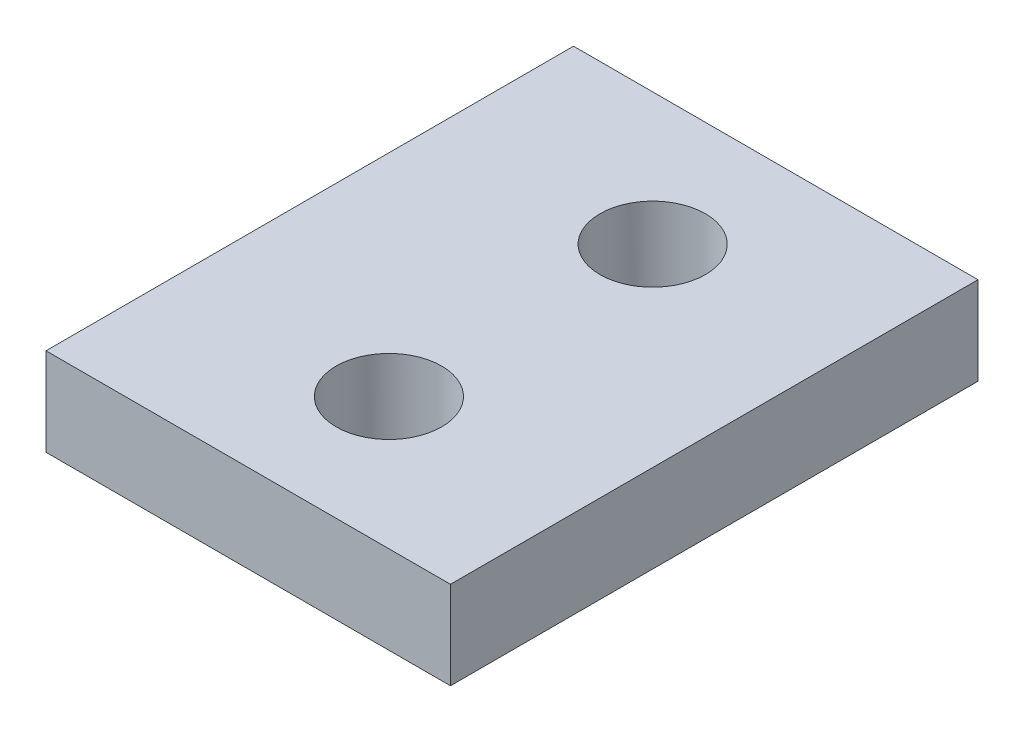
ISO-10303-21;
HEADER;
FILE_DESCRIPTION(('STEP AP214'),'2;1');
FILE_NAME('part.step','',(''),(''),'','','');
FILE_SCHEMA(('AUTOMOTIVE_DESIGN { 1 0 10303 214 1 1 1 1 }'));
ENDSEC;
DATA;
#1=APPLICATION_CONTEXT('core data for automotive mechanical design processes');
#2=APPLICATION_PROTOCOL_DEFINITION('international standard','automotive_design',2000,#1);
#3=PRODUCT_CONTEXT('',#1,'mechanical');
#4=PRODUCT('Part','Part','',(#3));
#5=PRODUCT_RELATED_PRODUCT_CATEGORY('part','',(#4));
#6=PRODUCT_DEFINITION_FORMATION('','',#4);
#7=PRODUCT_DEFINITION_CONTEXT('part definition',#1,'design');
#8=PRODUCT_DEFINITION('design','',#6,#7);
#9=PRODUCT_DEFINITION_SHAPE('','',#8);
#10=(LENGTH_UNIT() NAMED_UNIT(*) SI_UNIT(.MILLI.,.METRE.));
#11=(NAMED_UNIT(*) PLANE_ANGLE_UNIT() SI_UNIT($,.RADIAN.));
#12=(NAMED_UNIT(*) SI_UNIT($,.STERADIAN.) SOLID_ANGLE_UNIT());
#13=UNCERTAINTY_MEASURE_WITH_UNIT(LENGTH_MEASURE(1.E-05),#10,'distance_accuracy_value','');
#14=(GEOMETRIC_REPRESENTATION_CONTEXT(3) GLOBAL_UNCERTAINTY_ASSIGNED_CONTEXT((#13)) GLOBAL_UNIT_ASSIGNED_CONTEXT((#10,
#11,#12)) REPRESENTATION_CONTEXT('',''));
#15=CARTESIAN_POINT('',(0.,0.,0.));
#16=DIRECTION('',(0.,0.,1.));
#17=DIRECTION('',(1.,0.,0.));
#18=AXIS2_PLACEMENT_3D('',#15,#16,#17);
#19=CARTESIAN_POINT('',(-65.,-11.,15.));
#20=DIRECTION('',(1.,0.,0.));
#21=DIRECTION('',(0.,0.,-1.));
#22=AXIS2_PLACEMENT_3D('',#19,#20,#21);
#23=PLANE('',#22);
#24=DIRECTION('',(0.,0.,-1.));
#25=VECTOR('',#24,1.);
#26=CARTESIAN_POINT('',(-65.,-11.,15.));
#27=LINE('',#26,#25);
#28=CARTESIAN_POINT('',(-65.,-11.,15.));
#29=VERTEX_POINT('',#28);
#30=CARTESIAN_POINT('',(-65.,-11.,-15.));
#31=VERTEX_POINT('',#30);
#32=EDGE_CURVE('E106',#29,#31,#27,.T.);
#33=ORIENTED_EDGE('',*,*,#32,.T.);
#34=DIRECTION('',(0.,-1.,0.));
#35=VECTOR('',#34,1.);
#36=CARTESIAN_POINT('',(-65.,-11.,-15.));
#37=LINE('',#36,#35);
#38=CARTESIAN_POINT('',(-65.,-16.,-15.));
#39=VERTEX_POINT('',#38);
#40=EDGE_CURVE('E100',#31,#39,#37,.T.);
#41=ORIENTED_EDGE('',*,*,#40,.T.);
#42=DIRECTION('',(0.,0.,-1.));
#43=VECTOR('',#42,1.);
#44=CARTESIAN_POINT('',(-65.,-16.,15.));
#45=LINE('',#44,#43);
#46=CARTESIAN_POINT('',(-65.,-16.,15.));
#47=VERTEX_POINT('',#46);
#48=EDGE_CURVE('E11',#47,#39,#45,.T.);
#49=ORIENTED_EDGE('',*,*,#48,.F.);
#50=DIRECTION('',(0.,-1.,0.));
#51=VECTOR('',#50,1.);
#52=CARTESIAN_POINT('',(-65.,-11.,15.));
#53=LINE('',#52,#51);
#54=EDGE_CURVE('E121',#29,#47,#53,.T.);
#55=ORIENTED_EDGE('',*,*,#54,.F.);
#56=EDGE_LOOP('',(#33,#41,#49,#55));
#57=FACE_BOUND('',#56,.T.);
#58=ADVANCED_FACE('F45',(#57),#23,.F.);
#59=CARTESIAN_POINT('',(-65.,-16.,15.));
#60=DIRECTION('',(0.,1.,0.));
#61=DIRECTION('',(0.,0.,1.));
#62=AXIS2_PLACEMENT_3D('',#59,#60,#61);
#63=PLANE('',#62);
#64=CARTESIAN_POINT('',(-53.,-16.,-7.5));
#65=DIRECTION('',(0.,1.,0.));
#66=DIRECTION('',(0.,0.,1.));
#67=AXIS2_PLACEMENT_3D('',#64,#65,#66);
#68=CIRCLE('',#67,3.);
#69=CARTESIAN_POINT('',(-53.,-16.,-4.5));
#70=VERTEX_POINT('',#69);
#71=EDGE_CURVE('E138',#70,#70,#68,.F.);
#72=ORIENTED_EDGE('',*,*,#71,.F.);
#73=EDGE_LOOP('',(#72));
#74=FACE_BOUND('',#73,.T.);
#75=CARTESIAN_POINT('',(-53.,-16.,7.5));
#76=DIRECTION('',(0.,1.,0.));
#77=DIRECTION('',(0.,0.,1.));
#78=AXIS2_PLACEMENT_3D('',#75,#76,#77);
#79=CIRCLE('',#78,3.);
#80=CARTESIAN_POINT('',(-53.,-16.,10.5));
#81=VERTEX_POINT('',#80);
#82=EDGE_CURVE('E113',#81,#81,#79,.F.);
#83=ORIENTED_EDGE('',*,*,#82,.F.);
#84=EDGE_LOOP('',(#83));
#85=FACE_BOUND('',#84,.T.);
#86=ORIENTED_EDGE('',*,*,#48,.T.);
#87=DIRECTION('',(1.,0.,0.));
#88=VECTOR('',#87,1.);
#89=CARTESIAN_POINT('',(-65.,-16.,-15.));
#90=LINE('',#89,#88);
#91=CARTESIAN_POINT('',(-42.,-16.,-15.));
#92=VERTEX_POINT('',#91);
#93=EDGE_CURVE('E90',#39,#92,#90,.T.);
#94=ORIENTED_EDGE('',*,*,#93,.T.);
#95=DIRECTION('',(0.,0.,-1.));
#96=VECTOR('',#95,1.);
#97=CARTESIAN_POINT('',(-42.,-16.,15.));
#98=LINE('',#97,#96);
#99=CARTESIAN_POINT('',(-42.,-16.,15.));
#100=VERTEX_POINT('',#99);
#101=EDGE_CURVE('E54',#100,#92,#98,.T.);
#102=ORIENTED_EDGE('',*,*,#101,.F.);
#103=DIRECTION('',(1.,0.,0.));
#104=VECTOR('',#103,1.);
#105=CARTESIAN_POINT('',(-65.,-16.,15.));
#106=LINE('',#105,#104);
#107=EDGE_CURVE('E91',#47,#100,#106,.T.);
#108=ORIENTED_EDGE('',*,*,#107,.F.);
#109=EDGE_LOOP('',(#86,#94,#102,#108));
#110=FACE_BOUND('',#109,.T.);
#111=ADVANCED_FACE('F88',(#74,#85,#110),#63,.F.);
#112=CARTESIAN_POINT('',(-42.,-11.,15.));
#113=DIRECTION('',(-1.,0.,0.));
#114=DIRECTION('',(0.,0.,1.));
#115=AXIS2_PLACEMENT_3D('',#112,#113,#114);
#116=PLANE('',#115);
#117=ORIENTED_EDGE('',*,*,#101,.T.);
#118=DIRECTION('',(0.,1.,0.));
#119=VECTOR('',#118,1.);
#120=CARTESIAN_POINT('',(-42.,-11.,-15.));
#121=LINE('',#120,#119);
#122=CARTESIAN_POINT('',(-42.,-11.,-15.));
#123=VERTEX_POINT('',#122);
#124=EDGE_CURVE('E103',#92,#123,#121,.T.);
#125=ORIENTED_EDGE('',*,*,#124,.T.);
#126=DIRECTION('',(0.,0.,-1.));
#127=VECTOR('',#126,1.);
#128=CARTESIAN_POINT('',(-42.,-11.,15.));
#129=LINE('',#128,#127);
#130=CARTESIAN_POINT('',(-42.,-11.,15.));
#131=VERTEX_POINT('',#130);
#132=EDGE_CURVE('E132',#131,#123,#129,.T.);
#133=ORIENTED_EDGE('',*,*,#132,.F.);
#134=DIRECTION('',(0.,1.,0.));
#135=VECTOR('',#134,1.);
#136=CARTESIAN_POINT('',(-42.,-11.,15.));
#137=LINE('',#136,#135);
#138=EDGE_CURVE('E67',#100,#131,#137,.T.);
#139=ORIENTED_EDGE('',*,*,#138,.F.);
#140=EDGE_LOOP('',(#117,#125,#133,#139));
#141=FACE_BOUND('',#140,.T.);
#142=ADVANCED_FACE('F153',(#141),#116,.F.);
#143=CARTESIAN_POINT('',(-65.,-11.,15.));
#144=DIRECTION('',(0.,-1.,0.));
#145=DIRECTION('',(0.,0.,-1.));
#146=AXIS2_PLACEMENT_3D('',#143,#144,#145);
#147=PLANE('',#146);
#148=CARTESIAN_POINT('',(-53.,-11.,-7.5));
#149=DIRECTION('',(0.,-1.,0.));
#150=DIRECTION('',(0.,0.,-1.));
#151=AXIS2_PLACEMENT_3D('',#148,#149,#150);
#152=CIRCLE('',#151,3.);
#153=CARTESIAN_POINT('',(-53.,-11.,-10.5));
#154=VERTEX_POINT('',#153);
#155=EDGE_CURVE('E48',#154,#154,#152,.T.);
#156=ORIENTED_EDGE('',*,*,#155,.T.);
#157=EDGE_LOOP('',(#156));
#158=FACE_BOUND('',#157,.T.);
#159=CARTESIAN_POINT('',(-53.,-11.,7.5));
#160=DIRECTION('',(0.,-1.,0.));
#161=DIRECTION('',(0.,0.,-1.));
#162=AXIS2_PLACEMENT_3D('',#159,#160,#161);
#163=CIRCLE('',#162,3.);
#164=CARTESIAN_POINT('',(-53.,-11.,4.5));
#165=VERTEX_POINT('',#164);
#166=EDGE_CURVE('E111',#165,#165,#163,.T.);
#167=ORIENTED_EDGE('',*,*,#166,.T.);
#168=EDGE_LOOP('',(#167));
#169=FACE_BOUND('',#168,.T.);
#170=ORIENTED_EDGE('',*,*,#132,.T.);
#171=DIRECTION('',(-1.,0.,0.));
#172=VECTOR('',#171,1.);
#173=CARTESIAN_POINT('',(-65.,-11.,-15.));
#174=LINE('',#173,#172);
#175=EDGE_CURVE('E118',#123,#31,#174,.T.);
#176=ORIENTED_EDGE('',*,*,#175,.T.);
#177=ORIENTED_EDGE('',*,*,#32,.F.);
#178=DIRECTION('',(-1.,0.,0.));
#179=VECTOR('',#178,1.);
#180=CARTESIAN_POINT('',(-65.,-11.,15.));
#181=LINE('',#180,#179);
#182=EDGE_CURVE('E62',#131,#29,#181,.T.);
#183=ORIENTED_EDGE('',*,*,#182,.F.);
#184=EDGE_LOOP('',(#170,#176,#177,#183));
#185=FACE_BOUND('',#184,.T.);
#186=ADVANCED_FACE('F160',(#158,#169,#185),#147,.F.);
#187=CARTESIAN_POINT('',(0.,0.,15.));
#188=DIRECTION('',(0.,0.,1.));
#189=DIRECTION('',(1.,0.,0.));
#190=AXIS2_PLACEMENT_3D('',#187,#188,#189);
#191=PLANE('',#190);
#192=ORIENTED_EDGE('',*,*,#54,.T.);
#193=ORIENTED_EDGE('',*,*,#107,.T.);
#194=ORIENTED_EDGE('',*,*,#138,.T.);
#195=ORIENTED_EDGE('',*,*,#182,.T.);
#196=EDGE_LOOP('',(#192,#193,#194,#195));
#197=FACE_BOUND('',#196,.T.);
#198=ADVANCED_FACE('F166',(#197),#191,.T.);
#199=CARTESIAN_POINT('',(0.,0.,-15.));
#200=DIRECTION('',(0.,0.,1.));
#201=DIRECTION('',(1.,0.,0.));
#202=AXIS2_PLACEMENT_3D('',#199,#200,#201);
#203=PLANE('',#202);
#204=ORIENTED_EDGE('',*,*,#40,.F.);
#205=ORIENTED_EDGE('',*,*,#175,.F.);
#206=ORIENTED_EDGE('',*,*,#124,.F.);
#207=ORIENTED_EDGE('',*,*,#93,.F.);
#208=EDGE_LOOP('',(#204,#205,#206,#207));
#209=FACE_BOUND('',#208,.T.);
#210=ADVANCED_FACE('F98',(#209),#203,.F.);
#211=CARTESIAN_POINT('',(-53.,-24.4852813742386,7.5));
#212=DIRECTION('',(0.,1.,0.));
#213=DIRECTION('',(0.,0.,1.));
#214=AXIS2_PLACEMENT_3D('',#211,#212,#213);
#215=CYLINDRICAL_SURFACE('',#214,3.);
#216=ORIENTED_EDGE('',*,*,#82,.T.);
#217=EDGE_LOOP('',(#216));
#218=FACE_BOUND('',#217,.T.);
#219=ORIENTED_EDGE('',*,*,#166,.F.);
#220=EDGE_LOOP('',(#219));
#221=FACE_BOUND('',#220,.T.);
#222=ADVANCED_FACE('F149',(#218,#221),#215,.F.);
#223=CARTESIAN_POINT('',(-53.,-24.4852813742386,-7.5));
#224=DIRECTION('',(0.,1.,0.));
#225=DIRECTION('',(0.,0.,1.));
#226=AXIS2_PLACEMENT_3D('',#223,#224,#225);
#227=CYLINDRICAL_SURFACE('',#226,3.);
#228=ORIENTED_EDGE('',*,*,#71,.T.);
#229=EDGE_LOOP('',(#228));
#230=FACE_BOUND('',#229,.T.);
#231=ORIENTED_EDGE('',*,*,#155,.F.);
#232=EDGE_LOOP('',(#231));
#233=FACE_BOUND('',#232,.T.);
#234=ADVANCED_FACE('F173',(#230,#233),#227,.F.);
#235=CLOSED_SHELL('',(#58,#111,#142,#186,#198,#210,#222,#234));
#236=MANIFOLD_SOLID_BREP('B2',#235);
#237=ADVANCED_BREP_SHAPE_REPRESENTATION('',(#18,#236),#14);
#238=SHAPE_DEFINITION_REPRESENTATION(#9,#237);
ENDSEC;
END-ISO-10303-21;
